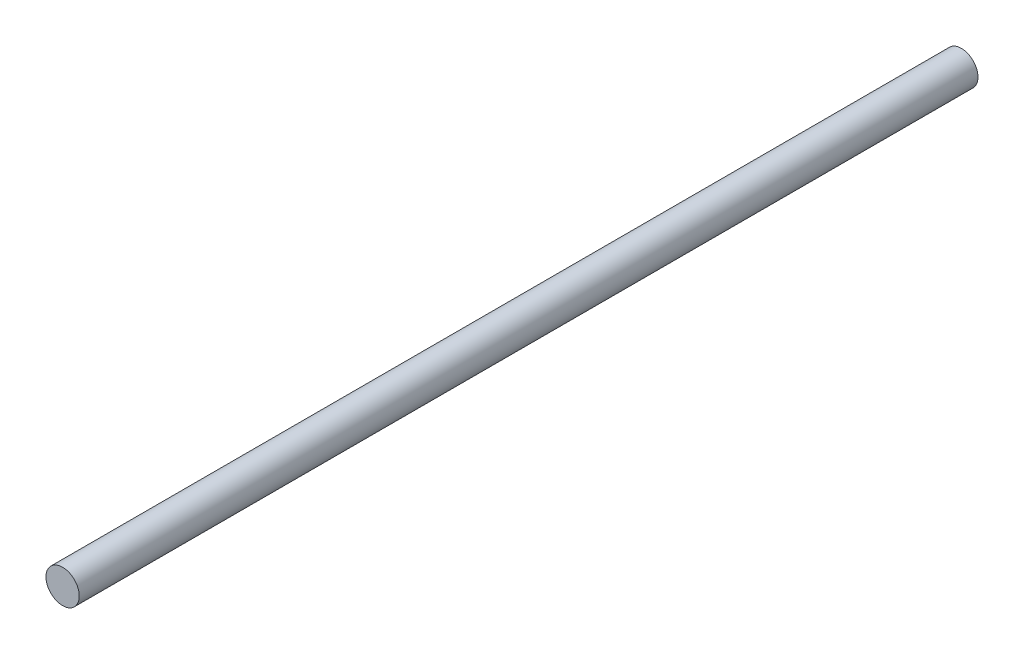
ISO-10303-21;
HEADER;
FILE_DESCRIPTION(('STEP AP214'),'2;1');
FILE_NAME('part.step','',(''),(''),'','','');
FILE_SCHEMA(('AUTOMOTIVE_DESIGN { 1 0 10303 214 1 1 1 1 }'));
ENDSEC;
DATA;
#1=APPLICATION_CONTEXT('core data for automotive mechanical design processes');
#2=APPLICATION_PROTOCOL_DEFINITION('international standard','automotive_design',2000,#1);
#3=PRODUCT_CONTEXT('',#1,'mechanical');
#4=PRODUCT('Part','Part','',(#3));
#5=PRODUCT_RELATED_PRODUCT_CATEGORY('part','',(#4));
#6=PRODUCT_DEFINITION_FORMATION('','',#4);
#7=PRODUCT_DEFINITION_CONTEXT('part definition',#1,'design');
#8=PRODUCT_DEFINITION('design','',#6,#7);
#9=PRODUCT_DEFINITION_SHAPE('','',#8);
#10=(LENGTH_UNIT() NAMED_UNIT(*) SI_UNIT(.MILLI.,.METRE.));
#11=(NAMED_UNIT(*) PLANE_ANGLE_UNIT() SI_UNIT($,.RADIAN.));
#12=(NAMED_UNIT(*) SI_UNIT($,.STERADIAN.) SOLID_ANGLE_UNIT());
#13=UNCERTAINTY_MEASURE_WITH_UNIT(LENGTH_MEASURE(1.E-05),#10,'distance_accuracy_value','');
#14=(GEOMETRIC_REPRESENTATION_CONTEXT(3) GLOBAL_UNCERTAINTY_ASSIGNED_CONTEXT((#13)) GLOBAL_UNIT_ASSIGNED_CONTEXT((#10,
#11,#12)) REPRESENTATION_CONTEXT('',''));
#15=CARTESIAN_POINT('',(0.,0.,0.));
#16=DIRECTION('',(0.,0.,1.));
#17=DIRECTION('',(1.,0.,0.));
#18=AXIS2_PLACEMENT_3D('',#15,#16,#17);
#19=CARTESIAN_POINT('',(0.,0.,342.9));
#20=DIRECTION('',(0.,0.,-1.));
#21=DIRECTION('',(-1.,0.,0.));
#22=AXIS2_PLACEMENT_3D('',#19,#20,#21);
#23=CYLINDRICAL_SURFACE('',#22,6.35);
#24=CARTESIAN_POINT('',(0.,0.,342.9));
#25=DIRECTION('',(0.,0.,1.));
#26=DIRECTION('',(1.,0.,0.));
#27=AXIS2_PLACEMENT_3D('',#24,#25,#26);
#28=CIRCLE('',#27,6.35);
#29=CARTESIAN_POINT('',(6.35,0.,342.9));
#30=VERTEX_POINT('',#29);
#31=EDGE_CURVE('E10',#30,#30,#28,.T.);
#32=ORIENTED_EDGE('',*,*,#31,.F.);
#33=EDGE_LOOP('',(#32));
#34=FACE_BOUND('',#33,.T.);
#35=CARTESIAN_POINT('',(0.,0.,0.));
#36=DIRECTION('',(0.,0.,1.));
#37=DIRECTION('',(1.,0.,0.));
#38=AXIS2_PLACEMENT_3D('',#35,#36,#37);
#39=CIRCLE('',#38,6.35);
#40=CARTESIAN_POINT('',(6.35,0.,0.));
#41=VERTEX_POINT('',#40);
#42=EDGE_CURVE('E46',#41,#41,#39,.T.);
#43=ORIENTED_EDGE('',*,*,#42,.T.);
#44=EDGE_LOOP('',(#43));
#45=FACE_BOUND('',#44,.T.);
#46=ADVANCED_FACE('F43',(#34,#45),#23,.T.);
#47=CARTESIAN_POINT('',(0.,0.,342.9));
#48=DIRECTION('',(0.,0.,1.));
#49=DIRECTION('',(1.,0.,0.));
#50=AXIS2_PLACEMENT_3D('',#47,#48,#49);
#51=PLANE('',#50);
#52=ORIENTED_EDGE('',*,*,#31,.T.);
#53=EDGE_LOOP('',(#52));
#54=FACE_BOUND('',#53,.T.);
#55=ADVANCED_FACE('F60',(#54),#51,.T.);
#56=CARTESIAN_POINT('',(0.,0.,0.));
#57=DIRECTION('',(0.,0.,1.));
#58=DIRECTION('',(1.,0.,0.));
#59=AXIS2_PLACEMENT_3D('',#56,#57,#58);
#60=PLANE('',#59);
#61=ORIENTED_EDGE('',*,*,#42,.F.);
#62=EDGE_LOOP('',(#61));
#63=FACE_BOUND('',#62,.T.);
#64=ADVANCED_FACE('F58',(#63),#60,.F.);
#65=CLOSED_SHELL('',(#46,#55,#64));
#66=MANIFOLD_SOLID_BREP('B2',#65);
#67=ADVANCED_BREP_SHAPE_REPRESENTATION('',(#18,#66),#14);
#68=SHAPE_DEFINITION_REPRESENTATION(#9,#67);
ENDSEC;
END-ISO-10303-21;
